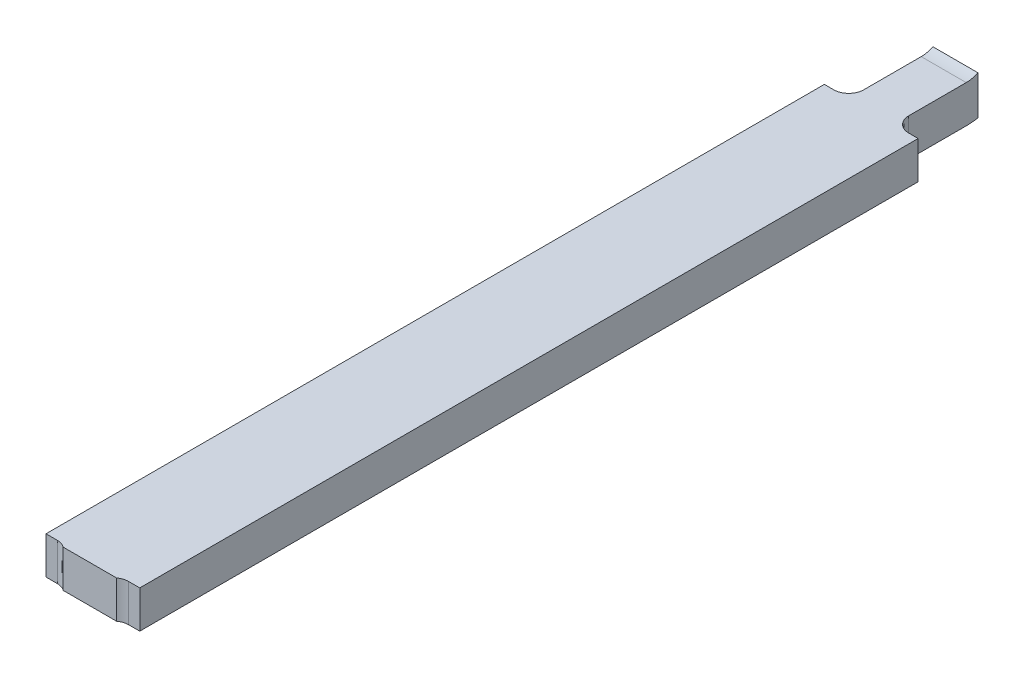
ISO-10303-21;
HEADER;
FILE_DESCRIPTION(('STEP AP214'),'2;1');
FILE_NAME('part.step','',(''),(''),'','','');
FILE_SCHEMA(('AUTOMOTIVE_DESIGN { 1 0 10303 214 1 1 1 1 }'));
ENDSEC;
DATA;
#1=APPLICATION_CONTEXT('core data for automotive mechanical design processes');
#2=APPLICATION_PROTOCOL_DEFINITION('international standard','automotive_design',2000,#1);
#3=PRODUCT_CONTEXT('',#1,'mechanical');
#4=PRODUCT('Part','Part','',(#3));
#5=PRODUCT_RELATED_PRODUCT_CATEGORY('part','',(#4));
#6=PRODUCT_DEFINITION_FORMATION('','',#4);
#7=PRODUCT_DEFINITION_CONTEXT('part definition',#1,'design');
#8=PRODUCT_DEFINITION('design','',#6,#7);
#9=PRODUCT_DEFINITION_SHAPE('','',#8);
#10=(LENGTH_UNIT() NAMED_UNIT(*) SI_UNIT(.MILLI.,.METRE.));
#11=(NAMED_UNIT(*) PLANE_ANGLE_UNIT() SI_UNIT($,.RADIAN.));
#12=(NAMED_UNIT(*) SI_UNIT($,.STERADIAN.) SOLID_ANGLE_UNIT());
#13=UNCERTAINTY_MEASURE_WITH_UNIT(LENGTH_MEASURE(1.E-05),#10,'distance_accuracy_value','');
#14=(GEOMETRIC_REPRESENTATION_CONTEXT(3) GLOBAL_UNCERTAINTY_ASSIGNED_CONTEXT((#13)) GLOBAL_UNIT_ASSIGNED_CONTEXT((#10,
#11,#12)) REPRESENTATION_CONTEXT('',''));
#15=CARTESIAN_POINT('',(0.,0.,0.));
#16=DIRECTION('',(0.,0.,1.));
#17=DIRECTION('',(1.,0.,0.));
#18=AXIS2_PLACEMENT_3D('',#15,#16,#17);
#19=CARTESIAN_POINT('',(2.,-0.3652289464185,-7.500488855463));
#20=DIRECTION('',(0.,0.,1.));
#21=DIRECTION('',(1.,0.,0.));
#22=AXIS2_PLACEMENT_3D('',#19,#20,#21);
#23=PLANE('',#22);
#24=DIRECTION('',(0.,1.,0.));
#25=VECTOR('',#24,1.);
#26=CARTESIAN_POINT('',(2.12,-0.3694122088881,-7.500488855463));
#27=LINE('',#26,#25);
#28=CARTESIAN_POINT('',(2.12,-0.469296338681694,-7.50048885546298));
#29=VERTEX_POINT('',#28);
#30=CARTESIAN_POINT('',(2.12,-0.261161554155171,-7.50048885546301));
#31=VERTEX_POINT('',#30);
#32=EDGE_CURVE('E150',#29,#31,#27,.T.);
#33=ORIENTED_EDGE('',*,*,#32,.F.);
#34=DIRECTION('',(-1.,0.,0.));
#35=VECTOR('',#34,1.);
#36=CARTESIAN_POINT('',(2.125727283719,-0.469296338681697,-7.50048885546296));
#37=LINE('',#36,#35);
#38=CARTESIAN_POINT('',(1.88,-0.469296338681694,-7.50048885546298));
#39=VERTEX_POINT('',#38);
#40=EDGE_CURVE('E139',#39,#29,#37,.F.);
#41=ORIENTED_EDGE('',*,*,#40,.F.);
#42=DIRECTION('',(0.,1.,0.));
#43=VECTOR('',#42,1.);
#44=CARTESIAN_POINT('',(1.88,-0.3694122088881,-7.500488855463));
#45=LINE('',#44,#43);
#46=CARTESIAN_POINT('',(1.88,-0.261161554155171,-7.50048885546301));
#47=VERTEX_POINT('',#46);
#48=EDGE_CURVE('E535',#39,#47,#45,.T.);
#49=ORIENTED_EDGE('',*,*,#48,.T.);
#50=DIRECTION('',(1.,0.,0.));
#51=VECTOR('',#50,1.);
#52=CARTESIAN_POINT('',(1.874272716281,-0.261161554155164,-7.50048885546303));
#53=LINE('',#52,#51);
#54=EDGE_CURVE('E147',#47,#31,#53,.T.);
#55=ORIENTED_EDGE('',*,*,#54,.T.);
#56=EDGE_LOOP('',(#33,#41,#49,#55));
#57=FACE_BOUND('',#56,.T.);
#58=ADVANCED_FACE('F17',(#57),#23,.F.);
#59=CARTESIAN_POINT('',(2.125727283719,-0.125,-7.43756007691));
#60=DIRECTION('',(-1.,0.,0.));
#61=DIRECTION('',(0.,0.,1.));
#62=AXIS2_PLACEMENT_3D('',#59,#60,#61);
#63=CYLINDRICAL_SURFACE('',#62,0.3499999999997);
#64=CARTESIAN_POINT('',(1.88,-0.125,-7.43756007691));
#65=DIRECTION('',(-1.,0.,0.));
#66=DIRECTION('',(0.,0.,1.));
#67=AXIS2_PLACEMENT_3D('',#64,#65,#66);
#68=CIRCLE('',#67,0.3499999999997);
#69=CARTESIAN_POINT('',(1.88,-0.475,-7.43756007691));
#70=VERTEX_POINT('',#69);
#71=EDGE_CURVE('E250',#70,#39,#68,.F.);
#72=ORIENTED_EDGE('',*,*,#71,.T.);
#73=ORIENTED_EDGE('',*,*,#40,.T.);
#74=CARTESIAN_POINT('',(2.12,-0.125,-7.43756007691));
#75=DIRECTION('',(-1.,0.,0.));
#76=DIRECTION('',(0.,0.,1.));
#77=AXIS2_PLACEMENT_3D('',#74,#75,#76);
#78=CIRCLE('',#77,0.3499999999997);
#79=CARTESIAN_POINT('',(2.12,-0.475,-7.43756007691));
#80=VERTEX_POINT('',#79);
#81=EDGE_CURVE('E274',#80,#29,#78,.F.);
#82=ORIENTED_EDGE('',*,*,#81,.F.);
#83=DIRECTION('',(1.,0.,0.));
#84=VECTOR('',#83,1.);
#85=CARTESIAN_POINT('',(2.,-0.475,-7.43756007691));
#86=LINE('',#85,#84);
#87=EDGE_CURVE('E138',#80,#70,#86,.F.);
#88=ORIENTED_EDGE('',*,*,#87,.T.);
#89=EDGE_LOOP('',(#72,#73,#82,#88));
#90=FACE_BOUND('',#89,.T.);
#91=ADVANCED_FACE('F255',(#90),#63,.T.);
#92=CARTESIAN_POINT('',(2.,-0.475,-5.160844573418));
#93=DIRECTION('',(0.,1.,0.));
#94=DIRECTION('',(0.,0.,1.));
#95=AXIS2_PLACEMENT_3D('',#92,#93,#94);
#96=PLANE('',#95);
#97=DIRECTION('',(1.,0.,0.));
#98=VECTOR('',#97,1.);
#99=CARTESIAN_POINT('',(2.,-0.475,-2.9));
#100=LINE('',#99,#98);
#101=CARTESIAN_POINT('',(1.75,-0.475,-2.9));
#102=VERTEX_POINT('',#101);
#103=CARTESIAN_POINT('',(1.81,-0.475,-2.89999999999976));
#104=VERTEX_POINT('',#103);
#105=EDGE_CURVE('E118',#102,#104,#100,.T.);
#106=ORIENTED_EDGE('',*,*,#105,.F.);
#107=DIRECTION('',(0.,0.,-1.));
#108=VECTOR('',#107,1.);
#109=CARTESIAN_POINT('',(1.75,-0.475,-4.975579331992));
#110=LINE('',#109,#108);
#111=CARTESIAN_POINT('',(1.75,-0.475,-7.051158663985));
#112=VERTEX_POINT('',#111);
#113=EDGE_CURVE('E213',#102,#112,#110,.T.);
#114=ORIENTED_EDGE('',*,*,#113,.T.);
#115=DIRECTION('',(1.,0.,0.));
#116=VECTOR('',#115,1.);
#117=CARTESIAN_POINT('',(1.775,-0.475,-7.051158663985));
#118=LINE('',#117,#116);
#119=CARTESIAN_POINT('',(1.8,-0.475,-7.05115866398505));
#120=VERTEX_POINT('',#119);
#121=EDGE_CURVE('E218',#112,#120,#118,.T.);
#122=ORIENTED_EDGE('',*,*,#121,.T.);
#123=CARTESIAN_POINT('',(1.88000000000032,-0.475,-7.131158663985));
#124=CARTESIAN_POINT('',(1.87999112440513,-0.475,-7.12663228539965));
#125=CARTESIAN_POINT('',(1.87960496952686,-0.475,-7.12211245444066));
#126=CARTESIAN_POINT('',(1.87808437325866,-0.475,-7.11320506981296));
#127=CARTESIAN_POINT('',(1.87695060689906,-0.475,-7.10881740054699));
#128=CARTESIAN_POINT('',(1.87244381446601,-0.475,-7.09604021502536));
#129=CARTESIAN_POINT('',(1.86796518134962,-0.475,-7.08801257629081));
#130=CARTESIAN_POINT('',(1.85665881135739,-0.475,-7.07397145931297));
#131=CARTESIAN_POINT('',(1.84985092513143,-0.475,-7.06794178198471));
#132=CARTESIAN_POINT('',(1.83457018431974,-0.475,-7.05845747919418));
#133=CARTESIAN_POINT('',(1.82608908375487,-0.475,-7.0550160305191));
#134=CARTESIAN_POINT('',(1.81161549132937,-0.475,-7.05178938735803));
#135=CARTESIAN_POINT('',(1.80580339960847,-0.475,-7.05114165155808));
#136=CARTESIAN_POINT('',(1.8,-0.475,-7.05115866398511));
#137=B_SPLINE_CURVE_WITH_KNOTS('',3,(#123,#124,#125,#126,#127,#128,#129,#130,#131,#132,#133,
#134,#135,#136),.UNSPECIFIED.,.F.,.F.,(4,2,2,2,2,2,4),(0.,0.013551279218449,0.0270903394941822,
0.0541002294468271,0.0808854407468273,0.107806110463883,0.125207976056708),.UNSPECIFIED.);
#138=CARTESIAN_POINT('',(1.88000000000016,-0.475,-7.131158663985));
#139=VERTEX_POINT('',#138);
#140=EDGE_CURVE('E239',#139,#120,#137,.T.);
#141=ORIENTED_EDGE('',*,*,#140,.F.);
#142=DIRECTION('',(0.,0.,-1.));
#143=VECTOR('',#142,1.);
#144=CARTESIAN_POINT('',(1.88,-0.475,-7.317732357319));
#145=LINE('',#144,#143);
#146=EDGE_CURVE('E537',#139,#70,#145,.T.);
#147=ORIENTED_EDGE('',*,*,#146,.T.);
#148=ORIENTED_EDGE('',*,*,#87,.F.);
#149=DIRECTION('',(0.,0.,-1.));
#150=VECTOR('',#149,1.);
#151=CARTESIAN_POINT('',(2.12,-0.475,-7.317732357319));
#152=LINE('',#151,#150);
#153=CARTESIAN_POINT('',(2.12000000000005,-0.475,-7.131158663985));
#154=VERTEX_POINT('',#153);
#155=EDGE_CURVE('E533',#154,#80,#152,.T.);
#156=ORIENTED_EDGE('',*,*,#155,.F.);
#157=CARTESIAN_POINT('',(2.2,-0.475,-7.05115866398468));
#158=CARTESIAN_POINT('',(2.19547362141465,-0.475,-7.05116753957987));
#159=CARTESIAN_POINT('',(2.19095379045565,-0.475,-7.05155369445814));
#160=CARTESIAN_POINT('',(2.18204640582796,-0.475,-7.05307429072634));
#161=CARTESIAN_POINT('',(2.17765873656199,-0.475,-7.05420805708594));
#162=CARTESIAN_POINT('',(2.16488155104036,-0.475,-7.05871484951899));
#163=CARTESIAN_POINT('',(2.15685391230581,-0.475,-7.06319348263538));
#164=CARTESIAN_POINT('',(2.14281279532796,-0.475,-7.07449985262762));
#165=CARTESIAN_POINT('',(2.13678311799971,-0.475,-7.08130773885357));
#166=CARTESIAN_POINT('',(2.12729881520918,-0.475,-7.09658847966527));
#167=CARTESIAN_POINT('',(2.12385736653409,-0.475,-7.10506958023015));
#168=CARTESIAN_POINT('',(2.12063072337303,-0.475,-7.11954317265564));
#169=CARTESIAN_POINT('',(2.11998298757308,-0.475,-7.12535526437654));
#170=CARTESIAN_POINT('',(2.12000000000011,-0.475,-7.131158663985));
#171=B_SPLINE_CURVE_WITH_KNOTS('',3,(#157,#158,#159,#160,#161,#162,#163,#164,#165,#166,#167,
#168,#169,#170),.UNSPECIFIED.,.F.,.F.,(4,2,2,2,2,2,4),(0.,0.0135512792184504,0.0270903394941851,
0.0541002294468347,0.0808854407468317,0.107806110463901,0.125207976056705),.UNSPECIFIED.);
#172=CARTESIAN_POINT('',(2.2,-0.475,-7.05115866398484));
#173=VERTEX_POINT('',#172);
#174=EDGE_CURVE('E266',#173,#154,#171,.T.);
#175=ORIENTED_EDGE('',*,*,#174,.F.);
#176=DIRECTION('',(1.,0.,0.));
#177=VECTOR('',#176,1.);
#178=CARTESIAN_POINT('',(2.225,-0.475,-7.051158663985));
#179=LINE('',#178,#177);
#180=CARTESIAN_POINT('',(2.25,-0.475,-7.051158663985));
#181=VERTEX_POINT('',#180);
#182=EDGE_CURVE('E151',#173,#181,#179,.T.);
#183=ORIENTED_EDGE('',*,*,#182,.T.);
#184=DIRECTION('',(0.,0.,-1.));
#185=VECTOR('',#184,1.);
#186=CARTESIAN_POINT('',(2.25,-0.475,-4.975579331992));
#187=LINE('',#186,#185);
#188=CARTESIAN_POINT('',(2.25,-0.475,-2.9));
#189=VERTEX_POINT('',#188);
#190=EDGE_CURVE('E155',#189,#181,#187,.T.);
#191=ORIENTED_EDGE('',*,*,#190,.F.);
#192=DIRECTION('',(1.,0.,0.));
#193=VECTOR('',#192,1.);
#194=CARTESIAN_POINT('',(2.22,-0.475,-2.9));
#195=LINE('',#194,#193);
#196=CARTESIAN_POINT('',(2.19,-0.475,-2.89999999999989));
#197=VERTEX_POINT('',#196);
#198=EDGE_CURVE('E163',#197,#189,#195,.T.);
#199=ORIENTED_EDGE('',*,*,#198,.F.);
#200=CARTESIAN_POINT('',(2.14217544757885,-0.475,-2.8841290699251));
#201=CARTESIAN_POINT('',(2.14622022070471,-0.475,-2.88715347788678));
#202=CARTESIAN_POINT('',(2.1505544258207,-0.475,-2.88978498732686));
#203=CARTESIAN_POINT('',(2.15913369497632,-0.475,-2.8939430866676));
#204=CARTESIAN_POINT('',(2.16333518410899,-0.475,-2.89555994023161));
#205=CARTESIAN_POINT('',(2.171948809422,-0.475,-2.89806057790455));
#206=CARTESIAN_POINT('',(2.17636081104945,-0.475,-2.898944823807));
#207=CARTESIAN_POINT('',(2.1838636348312,-0.475,-2.89981357444961));
#208=CARTESIAN_POINT('',(2.18693284156799,-0.475,-2.89999375978714));
#209=CARTESIAN_POINT('',(2.19,-0.475,-2.89999999999978));
#210=B_SPLINE_CURVE_WITH_KNOTS('',3,(#200,#201,#202,#203,#204,#205,#206,#207,#208,#209),
.UNSPECIFIED.,.F.,.F.,(4,2,2,2,4),(0.,0.0151223248428412,0.0285648972663177,0.0419989898086958,
0.0512012871013972),.UNSPECIFIED.);
#211=CARTESIAN_POINT('',(2.14217544757892,-0.475,-2.88412906992505));
#212=VERTEX_POINT('',#211);
#213=EDGE_CURVE('E125',#212,#197,#210,.T.);
#214=ORIENTED_EDGE('',*,*,#213,.F.);
#215=DIRECTION('',(1.,0.,0.));
#216=VECTOR('',#215,1.);
#217=CARTESIAN_POINT('',(2.,-0.475,-2.884129069925));
#218=LINE('',#217,#216);
#219=CARTESIAN_POINT('',(1.85782456637205,-0.475,-2.88412906992502));
#220=VERTEX_POINT('',#219);
#221=EDGE_CURVE('E129',#220,#212,#218,.T.);
#222=ORIENTED_EDGE('',*,*,#221,.F.);
#223=CARTESIAN_POINT('',(1.81,-0.475,-2.89999999999952));
#224=CARTESIAN_POINT('',(1.81503269638164,-0.475,-2.90001482409384));
#225=CARTESIAN_POINT('',(1.82008184216692,-0.475,-2.89952557596737));
#226=CARTESIAN_POINT('',(1.83385228395106,-0.475,-2.89686256447201));
#227=CARTESIAN_POINT('',(1.84239947608123,-0.475,-2.89367998586962));
#228=CARTESIAN_POINT('',(1.85280786570126,-0.475,-2.88765952253235));
#229=CARTESIAN_POINT('',(1.85537440128386,-0.475,-2.88596721904186));
#230=CARTESIAN_POINT('',(1.8578245663721,-0.475,-2.88412906992503));
#231=B_SPLINE_CURVE_WITH_KNOTS('',3,(#223,#224,#225,#226,#227,#228,#229,#230),.UNSPECIFIED.,.F.,
.F.,(4,2,2,4),(0.,0.0151178951010508,0.0419060489798912,0.0511063402020693),.UNSPECIFIED.);
#232=EDGE_CURVE('E20',#104,#220,#231,.T.);
#233=ORIENTED_EDGE('',*,*,#232,.F.);
#234=EDGE_LOOP('',(#106,#114,#122,#141,#147,#148,#156,#175,#183,#191,#199,#214,#222,#233));
#235=FACE_BOUND('',#234,.T.);
#236=ADVANCED_FACE('F135',(#235),#96,.F.);
#237=CARTESIAN_POINT('',(2.192867608479,-0.269272716281,-2.899957930186));
#238=CARTESIAN_POINT('',(2.191912675517,-0.269272716281,-2.899988554812));
#239=CARTESIAN_POINT('',(2.185731487658,-0.269272716281,-2.900079343105));
#240=CARTESIAN_POINT('',(2.174291413689,-0.269272716281,-2.898963559635));
#241=CARTESIAN_POINT('',(2.159190917084,-0.269272716281,-2.894390814224));
#242=CARTESIAN_POINT('',(2.1486873263,-0.269272716281,-2.888776760997));
#243=CARTESIAN_POINT('',(2.141721023167,-0.269272716281,-2.883851645707));
#244=CARTESIAN_POINT('',(2.139152051861,-0.269272716281,-2.881786274905));
#245=CARTESIAN_POINT('',(2.137705478113,-0.269272716281,-2.880535760884));
#246=(BOUNDED_CURVE() B_SPLINE_CURVE(3,(#237,#238,#239,#240,#241,#242,#243,#244,#245),
.UNSPECIFIED.,.F.,.F.) B_SPLINE_CURVE_WITH_KNOTS((4,1,1,1,1,1,4),(0.,0.0480076126077,
0.3103664664067,0.5726487803877,0.8349383013298,0.9041878403074,1.),
.UNSPECIFIED.) CURVE() GEOMETRIC_REPRESENTATION_ITEM() RATIONAL_B_SPLINE_CURVE((1.,1.,1.,1.,1.,
1.,1.,1.,1.)) REPRESENTATION_ITEM(''));
#247=DIRECTION('',(0.,-1.,0.));
#248=VECTOR('',#247,1.);
#249=SURFACE_OF_LINEAR_EXTRUSION('',#246,#248);
#250=CARTESIAN_POINT('',(2.14217544464746,-0.275,-2.88412906773656));
#251=CARTESIAN_POINT('',(2.14622021763433,-0.275,-2.88715347588347));
#252=CARTESIAN_POINT('',(2.15055442262976,-0.275,-2.88978498552233));
#253=CARTESIAN_POINT('',(2.15913369159401,-0.275,-2.89394308525624));
#254=CARTESIAN_POINT('',(2.16333518065167,-0.275,-2.89555993901276));
#255=CARTESIAN_POINT('',(2.17194880584973,-0.275,-2.89806057708111));
#256=CARTESIAN_POINT('',(2.17636080743732,-0.275,-2.89894482318606));
#257=CARTESIAN_POINT('',(2.18386363239325,-0.275,-2.89981357430863));
#258=CARTESIAN_POINT('',(2.18693284034915,-0.275,-2.89999375978684));
#259=CARTESIAN_POINT('',(2.19,-0.275,-2.89999999999978));
#260=B_SPLINE_CURVE_WITH_KNOTS('',3,(#250,#251,#252,#253,#254,#255,#256,#257,#258,#259),
.UNSPECIFIED.,.F.,.F.,(4,2,2,2,4),(0.,0.0151223248426715,0.0285648972632359,0.041998989809646,
0.0512012907536533),.UNSPECIFIED.);
#261=CARTESIAN_POINT('',(2.14217544611323,-0.275,-2.88412906883078));
#262=VERTEX_POINT('',#261);
#263=CARTESIAN_POINT('',(2.19,-0.275,-2.9));
#264=VERTEX_POINT('',#263);
#265=EDGE_CURVE('E132',#262,#264,#260,.T.);
#266=ORIENTED_EDGE('',*,*,#265,.F.);
#267=DIRECTION('',(0.,1.,0.));
#268=VECTOR('',#267,1.);
#269=CARTESIAN_POINT('',(2.142175447579,-0.375,-2.884129069925));
#270=LINE('',#269,#268);
#271=EDGE_CURVE('E133',#212,#262,#270,.T.);
#272=ORIENTED_EDGE('',*,*,#271,.F.);
#273=ORIENTED_EDGE('',*,*,#213,.T.);
#274=DIRECTION('',(0.,1.,0.));
#275=VECTOR('',#274,1.);
#276=CARTESIAN_POINT('',(2.19,-0.375,-2.9));
#277=LINE('',#276,#275);
#278=EDGE_CURVE('E166',#264,#197,#277,.F.);
#279=ORIENTED_EDGE('',*,*,#278,.F.);
#280=EDGE_LOOP('',(#266,#272,#273,#279));
#281=FACE_BOUND('',#280,.T.);
#282=ADVANCED_FACE('F254',(#281),#249,.T.);
#283=CARTESIAN_POINT('',(2.22,-0.375,-2.9));
#284=DIRECTION('',(0.,0.,1.));
#285=DIRECTION('',(1.,0.,0.));
#286=AXIS2_PLACEMENT_3D('',#283,#284,#285);
#287=PLANE('',#286);
#288=DIRECTION('',(0.,1.,0.));
#289=VECTOR('',#288,1.);
#290=CARTESIAN_POINT('',(2.25,-0.375,-2.9));
#291=LINE('',#290,#289);
#292=CARTESIAN_POINT('',(2.25,-0.275,-2.9));
#293=VERTEX_POINT('',#292);
#294=EDGE_CURVE('E160',#293,#189,#291,.F.);
#295=ORIENTED_EDGE('',*,*,#294,.F.);
#296=DIRECTION('',(1.,0.,0.));
#297=VECTOR('',#296,1.);
#298=CARTESIAN_POINT('',(2.,-0.275,-2.9));
#299=LINE('',#298,#297);
#300=EDGE_CURVE('E306',#264,#293,#299,.T.);
#301=ORIENTED_EDGE('',*,*,#300,.F.);
#302=ORIENTED_EDGE('',*,*,#278,.T.);
#303=ORIENTED_EDGE('',*,*,#198,.T.);
#304=EDGE_LOOP('',(#295,#301,#302,#303));
#305=FACE_BOUND('',#304,.T.);
#306=ADVANCED_FACE('F368',(#305),#287,.T.);
#307=CARTESIAN_POINT('',(2.25,-0.375,-4.975579331992));
#308=DIRECTION('',(1.,0.,0.));
#309=DIRECTION('',(0.,0.,-1.));
#310=AXIS2_PLACEMENT_3D('',#307,#308,#309);
#311=PLANE('',#310);
#312=DIRECTION('',(0.,1.,0.));
#313=VECTOR('',#312,1.);
#314=CARTESIAN_POINT('',(2.25,-0.375,-7.051158663985));
#315=LINE('',#314,#313);
#316=CARTESIAN_POINT('',(2.25,-0.275,-7.051158663985));
#317=VERTEX_POINT('',#316);
#318=EDGE_CURVE('E154',#181,#317,#315,.T.);
#319=ORIENTED_EDGE('',*,*,#318,.T.);
#320=DIRECTION('',(0.,0.,1.));
#321=VECTOR('',#320,1.);
#322=CARTESIAN_POINT('',(2.25,-0.275,-5.160844573418));
#323=LINE('',#322,#321);
#324=EDGE_CURVE('E302',#293,#317,#323,.F.);
#325=ORIENTED_EDGE('',*,*,#324,.F.);
#326=ORIENTED_EDGE('',*,*,#294,.T.);
#327=ORIENTED_EDGE('',*,*,#190,.T.);
#328=EDGE_LOOP('',(#319,#325,#326,#327));
#329=FACE_BOUND('',#328,.T.);
#330=ADVANCED_FACE('F373',(#329),#311,.T.);
#331=CARTESIAN_POINT('',(2.225,-0.375,-7.051158663985));
#332=DIRECTION('',(0.,0.,1.));
#333=DIRECTION('',(1.,0.,0.));
#334=AXIS2_PLACEMENT_3D('',#331,#332,#333);
#335=PLANE('',#334);
#336=ORIENTED_EDGE('',*,*,#182,.F.);
#337=DIRECTION('',(0.,-1.,0.));
#338=VECTOR('',#337,1.);
#339=CARTESIAN_POINT('',(2.2,-0.269272716281,-7.05115866398468));
#340=LINE('',#339,#338);
#341=CARTESIAN_POINT('',(2.2,-0.275,-7.05115866398476));
#342=VERTEX_POINT('',#341);
#343=EDGE_CURVE('E273',#342,#173,#340,.T.);
#344=ORIENTED_EDGE('',*,*,#343,.F.);
#345=DIRECTION('',(1.,0.,0.));
#346=VECTOR('',#345,1.);
#347=CARTESIAN_POINT('',(2.,-0.275,-7.051158663985));
#348=LINE('',#347,#346);
#349=EDGE_CURVE('E305',#317,#342,#348,.F.);
#350=ORIENTED_EDGE('',*,*,#349,.F.);
#351=ORIENTED_EDGE('',*,*,#318,.F.);
#352=EDGE_LOOP('',(#336,#344,#350,#351));
#353=FACE_BOUND('',#352,.T.);
#354=ADVANCED_FACE('F283',(#353),#335,.F.);
#355=CARTESIAN_POINT('',(2.120042070413,-0.269272716281,-7.134026291144));
#356=CARTESIAN_POINT('',(2.120011445371,-0.269272716281,-7.133071351971));
#357=CARTESIAN_POINT('',(2.119920656285,-0.269272716281,-7.126890157897));
#358=CARTESIAN_POINT('',(2.121036440365,-0.269272716281,-7.115450077674));
#359=CARTESIAN_POINT('',(2.125609185776,-0.269272716281,-7.100349581069));
#360=CARTESIAN_POINT('',(2.133048947975,-0.269272716281,-7.086430187272));
#361=CARTESIAN_POINT('',(2.143068695624,-0.269272716281,-7.074236320435));
#362=CARTESIAN_POINT('',(2.155262096496,-0.269272716281,-7.064213675467));
#363=CARTESIAN_POINT('',(2.169183798376,-0.269272716281,-7.056770327068));
#364=CARTESIAN_POINT('',(2.184287959508,-0.269272716281,-7.05219575577));
#365=CARTESIAN_POINT('',(2.195729514596,-0.269272716281,-7.051079350384));
#366=CARTESIAN_POINT('',(2.201910679261,-0.269272716281,-7.051170096432));
#367=CARTESIAN_POINT('',(2.202864618741,-0.269272716281,-7.0512006723));
#368=(BOUNDED_CURVE() B_SPLINE_CURVE(3,(#355,#356,#357,#358,#359,#360,#361,#362,#363,#364,#365,
#366,#367),.UNSPECIFIED.,.F.,.F.) B_SPLINE_CURVE_WITH_KNOTS((4,1,1,1,1,1,1,1,1,1,4),(0.,
0.02187366901521,0.1414112381412,0.260913933719,0.380419912977,0.4999590271853,0.6195124003892,
0.7390518477007,0.8585895788734,0.9781493142558,1.),
.UNSPECIFIED.) CURVE() GEOMETRIC_REPRESENTATION_ITEM() RATIONAL_B_SPLINE_CURVE((1.,1.,1.,1.,1.,
1.,1.,1.,1.,1.,1.,1.,1.)) REPRESENTATION_ITEM(''));
#369=DIRECTION('',(0.,-1.,0.));
#370=VECTOR('',#369,1.);
#371=SURFACE_OF_LINEAR_EXTRUSION('',#368,#370);
#372=DIRECTION('',(0.,1.,0.));
#373=VECTOR('',#372,1.);
#374=CARTESIAN_POINT('',(2.12,-0.3694122088881,-7.131158663985));
#375=LINE('',#374,#373);
#376=CARTESIAN_POINT('',(2.12,-0.275,-7.131158663985));
#377=VERTEX_POINT('',#376);
#378=EDGE_CURVE('E272',#377,#154,#375,.F.);
#379=ORIENTED_EDGE('',*,*,#378,.F.);
#380=CARTESIAN_POINT('',(2.2,-0.275,-7.05115866398468));
#381=CARTESIAN_POINT('',(2.19547362141465,-0.275,-7.05116753957987));
#382=CARTESIAN_POINT('',(2.19095379045565,-0.275,-7.05155369445814));
#383=CARTESIAN_POINT('',(2.18204640582796,-0.275,-7.05307429072634));
#384=CARTESIAN_POINT('',(2.17765873656199,-0.275,-7.05420805708594));
#385=CARTESIAN_POINT('',(2.16488155104036,-0.275,-7.05871484951899));
#386=CARTESIAN_POINT('',(2.15685391230581,-0.275,-7.06319348263538));
#387=CARTESIAN_POINT('',(2.14281279532796,-0.275,-7.07449985262762));
#388=CARTESIAN_POINT('',(2.13678311799971,-0.275,-7.08130773885357));
#389=CARTESIAN_POINT('',(2.12729881520918,-0.275,-7.09658847966527));
#390=CARTESIAN_POINT('',(2.12385736653409,-0.275,-7.10506958023015));
#391=CARTESIAN_POINT('',(2.12063072337303,-0.275,-7.11954317265564));
#392=CARTESIAN_POINT('',(2.11998298757308,-0.275,-7.12535526437654));
#393=CARTESIAN_POINT('',(2.12000000000011,-0.275,-7.131158663985));
#394=B_SPLINE_CURVE_WITH_KNOTS('',3,(#380,#381,#382,#383,#384,#385,#386,#387,#388,#389,#390,
#391,#392,#393),.UNSPECIFIED.,.F.,.F.,(4,2,2,2,2,2,4),(0.,0.0135512792184504,0.0270903394941851,
0.0541002294468347,0.0808854407468317,0.107806110463901,0.125207976056705),.UNSPECIFIED.);
#395=EDGE_CURVE('E355',#342,#377,#394,.T.);
#396=ORIENTED_EDGE('',*,*,#395,.F.);
#397=ORIENTED_EDGE('',*,*,#343,.T.);
#398=ORIENTED_EDGE('',*,*,#174,.T.);
#399=EDGE_LOOP('',(#379,#396,#397,#398));
#400=FACE_BOUND('',#399,.T.);
#401=ADVANCED_FACE('F276',(#400),#371,.T.);
#402=CARTESIAN_POINT('',(2.12,-0.3694122088881,-7.317732357319));
#403=DIRECTION('',(1.,0.,0.));
#404=DIRECTION('',(0.,0.,-1.));
#405=AXIS2_PLACEMENT_3D('',#402,#403,#404);
#406=PLANE('',#405);
#407=ORIENTED_EDGE('',*,*,#81,.T.);
#408=ORIENTED_EDGE('',*,*,#32,.T.);
#409=CARTESIAN_POINT('',(2.12,-0.125,-7.437560076911));
#410=DIRECTION('',(1.,0.,0.));
#411=DIRECTION('',(0.,0.,-1.));
#412=AXIS2_PLACEMENT_3D('',#409,#410,#411);
#413=CIRCLE('',#412,0.15);
#414=CARTESIAN_POINT('',(2.12,-0.275,-7.437560076911));
#415=VERTEX_POINT('',#414);
#416=EDGE_CURVE('E149',#31,#415,#413,.F.);
#417=ORIENTED_EDGE('',*,*,#416,.T.);
#418=DIRECTION('',(0.,0.,1.));
#419=VECTOR('',#418,1.);
#420=CARTESIAN_POINT('',(2.12,-0.275,-5.160844573418));
#421=LINE('',#420,#419);
#422=EDGE_CURVE('E348',#377,#415,#421,.F.);
#423=ORIENTED_EDGE('',*,*,#422,.F.);
#424=ORIENTED_EDGE('',*,*,#378,.T.);
#425=ORIENTED_EDGE('',*,*,#155,.T.);
#426=EDGE_LOOP('',(#407,#408,#417,#423,#424,#425));
#427=FACE_BOUND('',#426,.T.);
#428=ADVANCED_FACE('F282',(#427),#406,.T.);
#429=CARTESIAN_POINT('',(1.874272716281,-0.125,-7.437560076911));
#430=DIRECTION('',(1.,0.,0.));
#431=DIRECTION('',(0.,0.,-1.));
#432=AXIS2_PLACEMENT_3D('',#429,#430,#431);
#433=CYLINDRICAL_SURFACE('',#432,0.15);
#434=DIRECTION('',(1.,0.,0.));
#435=VECTOR('',#434,1.);
#436=CARTESIAN_POINT('',(2.,-0.275,-7.437560076911));
#437=LINE('',#436,#435);
#438=CARTESIAN_POINT('',(1.88,-0.275,-7.437560076911));
#439=VERTEX_POINT('',#438);
#440=EDGE_CURVE('E346',#415,#439,#437,.F.);
#441=ORIENTED_EDGE('',*,*,#440,.F.);
#442=ORIENTED_EDGE('',*,*,#416,.F.);
#443=ORIENTED_EDGE('',*,*,#54,.F.);
#444=CARTESIAN_POINT('',(1.88,-0.125,-7.437560076911));
#445=DIRECTION('',(1.,0.,0.));
#446=DIRECTION('',(0.,0.,-1.));
#447=AXIS2_PLACEMENT_3D('',#444,#445,#446);
#448=CIRCLE('',#447,0.15);
#449=EDGE_CURVE('E536',#47,#439,#448,.F.);
#450=ORIENTED_EDGE('',*,*,#449,.T.);
#451=EDGE_LOOP('',(#441,#442,#443,#450));
#452=FACE_BOUND('',#451,.T.);
#453=ADVANCED_FACE('F443',(#452),#433,.F.);
#454=CARTESIAN_POINT('',(1.88,-0.3694122088881,-7.317732357319));
#455=DIRECTION('',(1.,0.,0.));
#456=DIRECTION('',(0.,0.,-1.));
#457=AXIS2_PLACEMENT_3D('',#454,#455,#456);
#458=PLANE('',#457);
#459=ORIENTED_EDGE('',*,*,#146,.F.);
#460=DIRECTION('',(0.,-1.,0.));
#461=VECTOR('',#460,1.);
#462=CARTESIAN_POINT('',(1.88000000000032,-0.269272716281,-7.131158663985));
#463=LINE('',#462,#461);
#464=CARTESIAN_POINT('',(1.88000000000024,-0.275,-7.131158663985));
#465=VERTEX_POINT('',#464);
#466=EDGE_CURVE('E223',#465,#139,#463,.T.);
#467=ORIENTED_EDGE('',*,*,#466,.F.);
#468=DIRECTION('',(0.,0.,1.));
#469=VECTOR('',#468,1.);
#470=CARTESIAN_POINT('',(1.88,-0.275,-5.160844573418));
#471=LINE('',#470,#469);
#472=EDGE_CURVE('E345',#439,#465,#471,.T.);
#473=ORIENTED_EDGE('',*,*,#472,.F.);
#474=ORIENTED_EDGE('',*,*,#449,.F.);
#475=ORIENTED_EDGE('',*,*,#48,.F.);
#476=ORIENTED_EDGE('',*,*,#71,.F.);
#477=EDGE_LOOP('',(#459,#467,#473,#474,#475,#476));
#478=FACE_BOUND('',#477,.T.);
#479=ADVANCED_FACE('F234',(#478),#458,.F.);
#480=CARTESIAN_POINT('',(1.797132372841,-0.269272716281,-7.051200734398));
#481=CARTESIAN_POINT('',(1.798087312014,-0.269272716281,-7.051170109356));
#482=CARTESIAN_POINT('',(1.804268506088,-0.269272716281,-7.05107932027));
#483=CARTESIAN_POINT('',(1.815708586311,-0.269272716281,-7.05219510435));
#484=CARTESIAN_POINT('',(1.830809082916,-0.269272716281,-7.056767849761));
#485=CARTESIAN_POINT('',(1.844728476713,-0.269272716281,-7.06420761196));
#486=CARTESIAN_POINT('',(1.85692234355,-0.269272716281,-7.074227359609));
#487=CARTESIAN_POINT('',(1.866944988518,-0.269272716281,-7.086420760481));
#488=CARTESIAN_POINT('',(1.874388336917,-0.269272716281,-7.100342462361));
#489=CARTESIAN_POINT('',(1.878962908215,-0.269272716281,-7.115446623493));
#490=CARTESIAN_POINT('',(1.880079313601,-0.269272716281,-7.126888178581));
#491=CARTESIAN_POINT('',(1.879988567553,-0.269272716281,-7.133069343246));
#492=CARTESIAN_POINT('',(1.879957991685,-0.269272716281,-7.134023282726));
#493=(BOUNDED_CURVE() B_SPLINE_CURVE(3,(#480,#481,#482,#483,#484,#485,#486,#487,#488,#489,#490,
#491,#492),.UNSPECIFIED.,.F.,.F.) B_SPLINE_CURVE_WITH_KNOTS((4,1,1,1,1,1,1,1,1,1,4),(0.,
0.02187366901522,0.1414112381413,0.260913933719,0.380419912977,0.4999590271853,0.6195124003892,
0.7390518477007,0.8585895788734,0.9781493142558,1.),
.UNSPECIFIED.) CURVE() GEOMETRIC_REPRESENTATION_ITEM() RATIONAL_B_SPLINE_CURVE((1.,1.,1.,1.,1.,
1.,1.,1.,1.,1.,1.,1.,1.)) REPRESENTATION_ITEM(''));
#494=DIRECTION('',(0.,-1.,0.));
#495=VECTOR('',#494,1.);
#496=SURFACE_OF_LINEAR_EXTRUSION('',#493,#495);
#497=DIRECTION('',(0.,1.,0.));
#498=VECTOR('',#497,1.);
#499=CARTESIAN_POINT('',(1.8,-0.375,-7.051158663985));
#500=LINE('',#499,#498);
#501=CARTESIAN_POINT('',(1.8,-0.275,-7.051158663985));
#502=VERTEX_POINT('',#501);
#503=EDGE_CURVE('E216',#120,#502,#500,.T.);
#504=ORIENTED_EDGE('',*,*,#503,.T.);
#505=CARTESIAN_POINT('',(1.88000000000032,-0.275,-7.131158663985));
#506=CARTESIAN_POINT('',(1.87999112440513,-0.275,-7.12663228539965));
#507=CARTESIAN_POINT('',(1.87960496952686,-0.275,-7.12211245444066));
#508=CARTESIAN_POINT('',(1.87808437325866,-0.275,-7.11320506981296));
#509=CARTESIAN_POINT('',(1.87695060689906,-0.275,-7.10881740054699));
#510=CARTESIAN_POINT('',(1.87244381446601,-0.275,-7.09604021502536));
#511=CARTESIAN_POINT('',(1.86796518134962,-0.275,-7.08801257629081));
#512=CARTESIAN_POINT('',(1.85665881135739,-0.275,-7.07397145931297));
#513=CARTESIAN_POINT('',(1.84985092513143,-0.275,-7.06794178198471));
#514=CARTESIAN_POINT('',(1.83457018431974,-0.275,-7.05845747919418));
#515=CARTESIAN_POINT('',(1.82608908375487,-0.275,-7.0550160305191));
#516=CARTESIAN_POINT('',(1.81161549132937,-0.275,-7.05178938735803));
#517=CARTESIAN_POINT('',(1.80580339960847,-0.275,-7.05114165155808));
#518=CARTESIAN_POINT('',(1.8,-0.275,-7.05115866398511));
#519=B_SPLINE_CURVE_WITH_KNOTS('',3,(#505,#506,#507,#508,#509,#510,#511,#512,#513,#514,#515,
#516,#517,#518),.UNSPECIFIED.,.F.,.F.,(4,2,2,2,2,2,4),(0.,0.013551279218449,0.0270903394941822,
0.0541002294468271,0.0808854407468273,0.107806110463883,0.125207976056707),.UNSPECIFIED.);
#520=EDGE_CURVE('E175',#465,#502,#519,.T.);
#521=ORIENTED_EDGE('',*,*,#520,.F.);
#522=ORIENTED_EDGE('',*,*,#466,.T.);
#523=ORIENTED_EDGE('',*,*,#140,.T.);
#524=EDGE_LOOP('',(#504,#521,#522,#523));
#525=FACE_BOUND('',#524,.T.);
#526=ADVANCED_FACE('F228',(#525),#496,.T.);
#527=CARTESIAN_POINT('',(1.775,-0.375,-7.051158663985));
#528=DIRECTION('',(0.,0.,1.));
#529=DIRECTION('',(1.,0.,0.));
#530=AXIS2_PLACEMENT_3D('',#527,#528,#529);
#531=PLANE('',#530);
#532=ORIENTED_EDGE('',*,*,#121,.F.);
#533=DIRECTION('',(0.,1.,0.));
#534=VECTOR('',#533,1.);
#535=CARTESIAN_POINT('',(1.75,-0.375,-7.051158663985));
#536=LINE('',#535,#534);
#537=CARTESIAN_POINT('',(1.75,-0.275,-7.051158663985));
#538=VERTEX_POINT('',#537);
#539=EDGE_CURVE('E202',#112,#538,#536,.T.);
#540=ORIENTED_EDGE('',*,*,#539,.T.);
#541=DIRECTION('',(1.,0.,0.));
#542=VECTOR('',#541,1.);
#543=CARTESIAN_POINT('',(2.,-0.275,-7.051158663985));
#544=LINE('',#543,#542);
#545=EDGE_CURVE('E208',#502,#538,#544,.F.);
#546=ORIENTED_EDGE('',*,*,#545,.F.);
#547=ORIENTED_EDGE('',*,*,#503,.F.);
#548=EDGE_LOOP('',(#532,#540,#546,#547));
#549=FACE_BOUND('',#548,.T.);
#550=ADVANCED_FACE('F233',(#549),#531,.F.);
#551=CARTESIAN_POINT('',(1.75,-0.375,-4.975579331992));
#552=DIRECTION('',(1.,0.,0.));
#553=DIRECTION('',(0.,0.,-1.));
#554=AXIS2_PLACEMENT_3D('',#551,#552,#553);
#555=PLANE('',#554);
#556=ORIENTED_EDGE('',*,*,#113,.F.);
#557=DIRECTION('',(0.,1.,0.));
#558=VECTOR('',#557,1.);
#559=CARTESIAN_POINT('',(1.75,-0.375,-2.9));
#560=LINE('',#559,#558);
#561=CARTESIAN_POINT('',(1.75,-0.275,-2.9));
#562=VERTEX_POINT('',#561);
#563=EDGE_CURVE('E200',#562,#102,#560,.F.);
#564=ORIENTED_EDGE('',*,*,#563,.F.);
#565=DIRECTION('',(0.,0.,1.));
#566=VECTOR('',#565,1.);
#567=CARTESIAN_POINT('',(1.75,-0.275,-5.160844573418));
#568=LINE('',#567,#566);
#569=EDGE_CURVE('E205',#538,#562,#568,.T.);
#570=ORIENTED_EDGE('',*,*,#569,.F.);
#571=ORIENTED_EDGE('',*,*,#539,.F.);
#572=EDGE_LOOP('',(#556,#564,#570,#571));
#573=FACE_BOUND('',#572,.T.);
#574=ADVANCED_FACE('F384',(#573),#555,.F.);
#575=CARTESIAN_POINT('',(1.78,-0.375,-2.9));
#576=DIRECTION('',(0.,0.,1.));
#577=DIRECTION('',(1.,0.,0.));
#578=AXIS2_PLACEMENT_3D('',#575,#576,#577);
#579=PLANE('',#578);
#580=DIRECTION('',(0.,-1.,0.));
#581=VECTOR('',#580,1.);
#582=CARTESIAN_POINT('',(1.81,-0.269272716281,-2.89999999999952));
#583=LINE('',#582,#581);
#584=CARTESIAN_POINT('',(1.81,-0.275,-2.89999999999964));
#585=VERTEX_POINT('',#584);
#586=EDGE_CURVE('E122',#585,#104,#583,.T.);
#587=ORIENTED_EDGE('',*,*,#586,.F.);
#588=DIRECTION('',(1.,0.,0.));
#589=VECTOR('',#588,1.);
#590=CARTESIAN_POINT('',(2.,-0.275,-2.9));
#591=LINE('',#590,#589);
#592=EDGE_CURVE('E174',#562,#585,#591,.T.);
#593=ORIENTED_EDGE('',*,*,#592,.F.);
#594=ORIENTED_EDGE('',*,*,#563,.T.);
#595=ORIENTED_EDGE('',*,*,#105,.T.);
#596=EDGE_LOOP('',(#587,#593,#594,#595));
#597=FACE_BOUND('',#596,.T.);
#598=ADVANCED_FACE('F188',(#597),#579,.T.);
#599=CARTESIAN_POINT('',(1.862294531819,-0.269272716281,-2.880535754175));
#600=CARTESIAN_POINT('',(1.860847959215,-0.269272716281,-2.881786269205));
#601=CARTESIAN_POINT('',(1.858282097423,-0.269272716281,-2.88384914542));
#602=CARTESIAN_POINT('',(1.851318238129,-0.269272716281,-2.888773339751));
#603=CARTESIAN_POINT('',(1.840816201624,-0.269272716281,-2.894388336917));
#604=CARTESIAN_POINT('',(1.825712040492,-0.269272716281,-2.898962908215));
#605=CARTESIAN_POINT('',(1.814270490801,-0.269272716281,-2.900079313074));
#606=CARTESIAN_POINT('',(1.808089331501,-0.269272716281,-2.89998856771));
#607=CARTESIAN_POINT('',(1.807135397382,-0.269272716281,-2.899957992201));
#608=(BOUNDED_CURVE() B_SPLINE_CURVE(3,(#599,#600,#601,#602,#603,#604,#605,#606,#607),
.UNSPECIFIED.,.F.,.F.) B_SPLINE_CURVE_WITH_KNOTS((4,1,1,1,1,1,4),(0.,0.09581704921696,
0.1648704820857,0.4272468470588,0.6896194452896,0.952040340422,1.),
.UNSPECIFIED.) CURVE() GEOMETRIC_REPRESENTATION_ITEM() RATIONAL_B_SPLINE_CURVE((1.,1.,1.,1.,1.,
1.,1.,1.,1.)) REPRESENTATION_ITEM(''));
#609=DIRECTION('',(0.,-1.,0.));
#610=VECTOR('',#609,1.);
#611=SURFACE_OF_LINEAR_EXTRUSION('',#608,#610);
#612=ORIENTED_EDGE('',*,*,#232,.T.);
#613=DIRECTION('',(0.,1.,0.));
#614=VECTOR('',#613,1.);
#615=CARTESIAN_POINT('',(1.857824566372,-0.375,-2.884129069925));
#616=LINE('',#615,#614);
#617=CARTESIAN_POINT('',(1.857824566372,-0.275,-2.884129069925));
#618=VERTEX_POINT('',#617);
#619=EDGE_CURVE('E40',#618,#220,#616,.F.);
#620=ORIENTED_EDGE('',*,*,#619,.F.);
#621=CARTESIAN_POINT('',(1.81,-0.275,-2.89999999999952));
#622=CARTESIAN_POINT('',(1.81503269638417,-0.275,-2.90001482409393));
#623=CARTESIAN_POINT('',(1.82008184216854,-0.275,-2.89952557596743));
#624=CARTESIAN_POINT('',(1.83385228394818,-0.275,-2.89686256447191));
#625=CARTESIAN_POINT('',(1.84239947607325,-0.275,-2.89367998586934));
#626=CARTESIAN_POINT('',(1.85280786675372,-0.275,-2.88765952192526));
#627=CARTESIAN_POINT('',(1.85537440331593,-0.275,-2.88596721770684));
#628=CARTESIAN_POINT('',(1.8578245692854,-0.275,-2.88412906774999));
#629=B_SPLINE_CURVE_WITH_KNOTS('',3,(#621,#622,#623,#624,#625,#626,#627,#628),.UNSPECIFIED.,.F.,
.F.,(4,2,2,4),(0.,0.0151178951010509,0.0419060489798788,0.0511063438316901),.UNSPECIFIED.);
#630=EDGE_CURVE('E31',#585,#618,#629,.T.);
#631=ORIENTED_EDGE('',*,*,#630,.F.);
#632=ORIENTED_EDGE('',*,*,#586,.T.);
#633=EDGE_LOOP('',(#612,#620,#631,#632));
#634=FACE_BOUND('',#633,.T.);
#635=ADVANCED_FACE('F121',(#634),#611,.T.);
#636=CARTESIAN_POINT('',(2.000000006976,-0.375,-2.884129069925));
#637=DIRECTION('',(0.,0.,1.));
#638=DIRECTION('',(1.,0.,0.));
#639=AXIS2_PLACEMENT_3D('',#636,#637,#638);
#640=PLANE('',#639);
#641=ORIENTED_EDGE('',*,*,#619,.T.);
#642=ORIENTED_EDGE('',*,*,#221,.T.);
#643=ORIENTED_EDGE('',*,*,#271,.T.);
#644=DIRECTION('',(1.,0.,0.));
#645=VECTOR('',#644,1.);
#646=CARTESIAN_POINT('',(2.,-0.275,-2.884129069925));
#647=LINE('',#646,#645);
#648=EDGE_CURVE('E11',#618,#262,#647,.T.);
#649=ORIENTED_EDGE('',*,*,#648,.F.);
#650=EDGE_LOOP('',(#641,#642,#643,#649));
#651=FACE_BOUND('',#650,.T.);
#652=ADVANCED_FACE('F127',(#651),#640,.T.);
#653=CARTESIAN_POINT('',(2.,-0.275,-5.160844573418));
#654=DIRECTION('',(0.,1.,0.));
#655=DIRECTION('',(0.,0.,1.));
#656=AXIS2_PLACEMENT_3D('',#653,#654,#655);
#657=PLANE('',#656);
#658=ORIENTED_EDGE('',*,*,#630,.T.);
#659=ORIENTED_EDGE('',*,*,#648,.T.);
#660=ORIENTED_EDGE('',*,*,#265,.T.);
#661=ORIENTED_EDGE('',*,*,#300,.T.);
#662=ORIENTED_EDGE('',*,*,#324,.T.);
#663=ORIENTED_EDGE('',*,*,#349,.T.);
#664=ORIENTED_EDGE('',*,*,#395,.T.);
#665=ORIENTED_EDGE('',*,*,#422,.T.);
#666=ORIENTED_EDGE('',*,*,#440,.T.);
#667=ORIENTED_EDGE('',*,*,#472,.T.);
#668=ORIENTED_EDGE('',*,*,#520,.T.);
#669=ORIENTED_EDGE('',*,*,#545,.T.);
#670=ORIENTED_EDGE('',*,*,#569,.T.);
#671=ORIENTED_EDGE('',*,*,#592,.T.);
#672=EDGE_LOOP('',(#658,#659,#660,#661,#662,#663,#664,#665,#666,#667,#668,#669,#670,#671));
#673=FACE_BOUND('',#672,.T.);
#674=ADVANCED_FACE('F181',(#673),#657,.T.);
#675=CLOSED_SHELL('',(#58,#91,#236,#282,#306,#330,#354,#401,#428,#453,#479,#526,#550,#574,#598,
#635,#652,#674));
#676=MANIFOLD_SOLID_BREP('B1',#675);
#677=ADVANCED_BREP_SHAPE_REPRESENTATION('',(#18,#676),#14);
#678=SHAPE_DEFINITION_REPRESENTATION(#9,#677);
ENDSEC;
END-ISO-10303-21;
